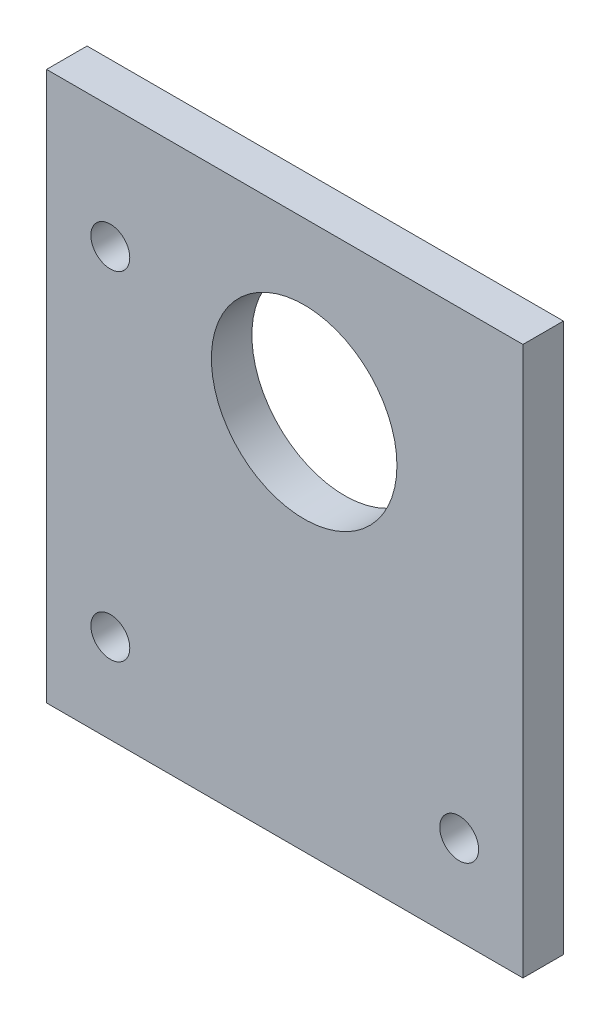
ISO-10303-21;
HEADER;
FILE_DESCRIPTION(('STEP AP214'),'2;1');
FILE_NAME('part.step','',(''),(''),'','','');
FILE_SCHEMA(('AUTOMOTIVE_DESIGN { 1 0 10303 214 1 1 1 1 }'));
ENDSEC;
DATA;
#1=APPLICATION_CONTEXT('core data for automotive mechanical design processes');
#2=APPLICATION_PROTOCOL_DEFINITION('international standard','automotive_design',2000,#1);
#3=PRODUCT_CONTEXT('',#1,'mechanical');
#4=PRODUCT('Part','Part','',(#3));
#5=PRODUCT_RELATED_PRODUCT_CATEGORY('part','',(#4));
#6=PRODUCT_DEFINITION_FORMATION('','',#4);
#7=PRODUCT_DEFINITION_CONTEXT('part definition',#1,'design');
#8=PRODUCT_DEFINITION('design','',#6,#7);
#9=PRODUCT_DEFINITION_SHAPE('','',#8);
#10=(LENGTH_UNIT() NAMED_UNIT(*) SI_UNIT(.MILLI.,.METRE.));
#11=(NAMED_UNIT(*) PLANE_ANGLE_UNIT() SI_UNIT($,.RADIAN.));
#12=(NAMED_UNIT(*) SI_UNIT($,.STERADIAN.) SOLID_ANGLE_UNIT());
#13=UNCERTAINTY_MEASURE_WITH_UNIT(LENGTH_MEASURE(1.E-05),#10,'distance_accuracy_value','');
#14=(GEOMETRIC_REPRESENTATION_CONTEXT(3) GLOBAL_UNCERTAINTY_ASSIGNED_CONTEXT((#13)) GLOBAL_UNIT_ASSIGNED_CONTEXT((#10,
#11,#12)) REPRESENTATION_CONTEXT('',''));
#15=CARTESIAN_POINT('',(0.,0.,0.));
#16=DIRECTION('',(0.,0.,1.));
#17=DIRECTION('',(1.,0.,0.));
#18=AXIS2_PLACEMENT_3D('',#15,#16,#17);
#19=CARTESIAN_POINT('',(0.,-59.69,6.35));
#20=DIRECTION('',(0.,1.,0.));
#21=DIRECTION('',(0.,0.,1.));
#22=AXIS2_PLACEMENT_3D('',#19,#20,#21);
#23=PLANE('',#22);
#24=DIRECTION('',(1.,0.,0.));
#25=VECTOR('',#24,1.);
#26=CARTESIAN_POINT('',(0.,-59.69,0.));
#27=LINE('',#26,#25);
#28=CARTESIAN_POINT('',(-40.3774369352808,-59.69,0.));
#29=VERTEX_POINT('',#28);
#30=CARTESIAN_POINT('',(34.29,-59.69,0.));
#31=VERTEX_POINT('',#30);
#32=EDGE_CURVE('E129',#29,#31,#27,.T.);
#33=ORIENTED_EDGE('',*,*,#32,.T.);
#34=DIRECTION('',(0.,0.,-1.));
#35=VECTOR('',#34,1.);
#36=CARTESIAN_POINT('',(34.29,-59.69,6.35));
#37=LINE('',#36,#35);
#38=CARTESIAN_POINT('',(34.29,-59.69,6.35));
#39=VERTEX_POINT('',#38);
#40=EDGE_CURVE('E11',#39,#31,#37,.T.);
#41=ORIENTED_EDGE('',*,*,#40,.F.);
#42=DIRECTION('',(1.,0.,0.));
#43=VECTOR('',#42,1.);
#44=CARTESIAN_POINT('',(0.,-59.69,6.35));
#45=LINE('',#44,#43);
#46=CARTESIAN_POINT('',(-40.3774369352808,-59.69,6.35));
#47=VERTEX_POINT('',#46);
#48=EDGE_CURVE('E95',#47,#39,#45,.T.);
#49=ORIENTED_EDGE('',*,*,#48,.F.);
#50=DIRECTION('',(0.,0.,-1.));
#51=VECTOR('',#50,1.);
#52=CARTESIAN_POINT('',(-40.3774369352808,-59.69,6.35));
#53=LINE('',#52,#51);
#54=EDGE_CURVE('E61',#47,#29,#53,.T.);
#55=ORIENTED_EDGE('',*,*,#54,.T.);
#56=EDGE_LOOP('',(#33,#41,#49,#55));
#57=FACE_BOUND('',#56,.T.);
#58=ADVANCED_FACE('F44',(#57),#23,.F.);
#59=CARTESIAN_POINT('',(34.29,0.,6.35));
#60=DIRECTION('',(-1.,0.,0.));
#61=DIRECTION('',(0.,0.,1.));
#62=AXIS2_PLACEMENT_3D('',#59,#60,#61);
#63=PLANE('',#62);
#64=DIRECTION('',(0.,1.,0.));
#65=VECTOR('',#64,1.);
#66=CARTESIAN_POINT('',(34.29,0.,0.));
#67=LINE('',#66,#65);
#68=CARTESIAN_POINT('',(34.29,26.3123969023602,0.));
#69=VERTEX_POINT('',#68);
#70=EDGE_CURVE('E101',#31,#69,#67,.T.);
#71=ORIENTED_EDGE('',*,*,#70,.T.);
#72=DIRECTION('',(0.,0.,-1.));
#73=VECTOR('',#72,1.);
#74=CARTESIAN_POINT('',(34.29,26.3123969023602,6.35));
#75=LINE('',#74,#73);
#76=CARTESIAN_POINT('',(34.29,26.3123969023602,6.35));
#77=VERTEX_POINT('',#76);
#78=EDGE_CURVE('E53',#77,#69,#75,.T.);
#79=ORIENTED_EDGE('',*,*,#78,.F.);
#80=DIRECTION('',(0.,1.,0.));
#81=VECTOR('',#80,1.);
#82=CARTESIAN_POINT('',(34.29,0.,6.35));
#83=LINE('',#82,#81);
#84=EDGE_CURVE('E86',#39,#77,#83,.T.);
#85=ORIENTED_EDGE('',*,*,#84,.F.);
#86=ORIENTED_EDGE('',*,*,#40,.T.);
#87=EDGE_LOOP('',(#71,#79,#85,#86));
#88=FACE_BOUND('',#87,.T.);
#89=ADVANCED_FACE('F100',(#88),#63,.F.);
#90=CARTESIAN_POINT('',(0.,26.3123969023602,6.35));
#91=DIRECTION('',(0.,1.,0.));
#92=DIRECTION('',(0.,0.,1.));
#93=AXIS2_PLACEMENT_3D('',#90,#91,#92);
#94=PLANE('',#93);
#95=DIRECTION('',(1.,0.,0.));
#96=VECTOR('',#95,1.);
#97=CARTESIAN_POINT('',(0.,26.3123969023602,0.));
#98=LINE('',#97,#96);
#99=CARTESIAN_POINT('',(-40.3774369352808,26.3123969023602,0.));
#100=VERTEX_POINT('',#99);
#101=EDGE_CURVE('E134',#100,#69,#98,.T.);
#102=ORIENTED_EDGE('',*,*,#101,.F.);
#103=DIRECTION('',(0.,0.,-1.));
#104=VECTOR('',#103,1.);
#105=CARTESIAN_POINT('',(-40.3774369352808,26.3123969023602,6.35));
#106=LINE('',#105,#104);
#107=CARTESIAN_POINT('',(-40.3774369352808,26.3123969023602,6.35));
#108=VERTEX_POINT('',#107);
#109=EDGE_CURVE('E75',#108,#100,#106,.T.);
#110=ORIENTED_EDGE('',*,*,#109,.F.);
#111=DIRECTION('',(1.,0.,0.));
#112=VECTOR('',#111,1.);
#113=CARTESIAN_POINT('',(0.,26.3123969023602,6.35));
#114=LINE('',#113,#112);
#115=EDGE_CURVE('E94',#108,#77,#114,.T.);
#116=ORIENTED_EDGE('',*,*,#115,.T.);
#117=ORIENTED_EDGE('',*,*,#78,.T.);
#118=EDGE_LOOP('',(#102,#110,#116,#117));
#119=FACE_BOUND('',#118,.T.);
#120=ADVANCED_FACE('F105',(#119),#94,.T.);
#121=CARTESIAN_POINT('',(24.2951,-45.72,6.35));
#122=DIRECTION('',(0.,0.,-1.));
#123=DIRECTION('',(-1.,0.,0.));
#124=AXIS2_PLACEMENT_3D('',#121,#122,#123);
#125=CYLINDRICAL_SURFACE('',#124,3.048);
#126=CARTESIAN_POINT('',(24.2951,-45.72,6.35));
#127=DIRECTION('',(0.,0.,1.));
#128=DIRECTION('',(1.,0.,0.));
#129=AXIS2_PLACEMENT_3D('',#126,#127,#128);
#130=CIRCLE('',#129,3.048);
#131=CARTESIAN_POINT('',(27.3431,-45.72,6.35));
#132=VERTEX_POINT('',#131);
#133=EDGE_CURVE('E121',#132,#132,#130,.T.);
#134=ORIENTED_EDGE('',*,*,#133,.T.);
#135=EDGE_LOOP('',(#134));
#136=FACE_BOUND('',#135,.T.);
#137=CARTESIAN_POINT('',(24.2951,-45.72,0.));
#138=DIRECTION('',(0.,0.,1.));
#139=DIRECTION('',(1.,0.,0.));
#140=AXIS2_PLACEMENT_3D('',#137,#138,#139);
#141=CIRCLE('',#140,3.048);
#142=CARTESIAN_POINT('',(27.3431,-45.72,0.));
#143=VERTEX_POINT('',#142);
#144=EDGE_CURVE('E149',#143,#143,#141,.T.);
#145=ORIENTED_EDGE('',*,*,#144,.F.);
#146=EDGE_LOOP('',(#145));
#147=FACE_BOUND('',#146,.T.);
#148=ADVANCED_FACE('F192',(#136,#147),#125,.F.);
#149=CARTESIAN_POINT('',(0.,0.,6.35));
#150=DIRECTION('',(0.,0.,-1.));
#151=DIRECTION('',(-1.,0.,0.));
#152=AXIS2_PLACEMENT_3D('',#149,#150,#151);
#153=CYLINDRICAL_SURFACE('',#152,14.5415);
#154=CARTESIAN_POINT('',(0.,0.,6.35));
#155=DIRECTION('',(0.,0.,1.));
#156=DIRECTION('',(1.,0.,0.));
#157=AXIS2_PLACEMENT_3D('',#154,#155,#156);
#158=CIRCLE('',#157,14.5415);
#159=CARTESIAN_POINT('',(14.5415,0.,6.35));
#160=VERTEX_POINT('',#159);
#161=EDGE_CURVE('E117',#160,#160,#158,.T.);
#162=ORIENTED_EDGE('',*,*,#161,.T.);
#163=EDGE_LOOP('',(#162));
#164=FACE_BOUND('',#163,.T.);
#165=CARTESIAN_POINT('',(0.,0.,0.));
#166=DIRECTION('',(0.,0.,1.));
#167=DIRECTION('',(1.,0.,0.));
#168=AXIS2_PLACEMENT_3D('',#165,#166,#167);
#169=CIRCLE('',#168,14.5415);
#170=CARTESIAN_POINT('',(14.5415,0.,0.));
#171=VERTEX_POINT('',#170);
#172=EDGE_CURVE('E145',#171,#171,#169,.T.);
#173=ORIENTED_EDGE('',*,*,#172,.F.);
#174=EDGE_LOOP('',(#173));
#175=FACE_BOUND('',#174,.T.);
#176=ADVANCED_FACE('F194',(#164,#175),#153,.F.);
#177=CARTESIAN_POINT('',(-30.3825369352808,7.26239690236022,6.35));
#178=DIRECTION('',(0.,0.,-1.));
#179=DIRECTION('',(-1.,0.,0.));
#180=AXIS2_PLACEMENT_3D('',#177,#178,#179);
#181=CYLINDRICAL_SURFACE('',#180,3.048);
#182=CARTESIAN_POINT('',(-30.3825369352808,7.26239690236022,6.35));
#183=DIRECTION('',(0.,0.,1.));
#184=DIRECTION('',(1.,0.,0.));
#185=AXIS2_PLACEMENT_3D('',#182,#183,#184);
#186=CIRCLE('',#185,3.048);
#187=CARTESIAN_POINT('',(-27.3345369352808,7.26239690236022,6.35));
#188=VERTEX_POINT('',#187);
#189=EDGE_CURVE('E110',#188,#188,#186,.T.);
#190=ORIENTED_EDGE('',*,*,#189,.T.);
#191=EDGE_LOOP('',(#190));
#192=FACE_BOUND('',#191,.T.);
#193=CARTESIAN_POINT('',(-30.3825369352808,7.26239690236022,0.));
#194=DIRECTION('',(0.,0.,1.));
#195=DIRECTION('',(1.,0.,0.));
#196=AXIS2_PLACEMENT_3D('',#193,#194,#195);
#197=CIRCLE('',#196,3.048);
#198=CARTESIAN_POINT('',(-27.3345369352808,7.26239690236022,0.));
#199=VERTEX_POINT('',#198);
#200=EDGE_CURVE('E141',#199,#199,#197,.T.);
#201=ORIENTED_EDGE('',*,*,#200,.F.);
#202=EDGE_LOOP('',(#201));
#203=FACE_BOUND('',#202,.T.);
#204=ADVANCED_FACE('F175',(#192,#203),#181,.F.);
#205=CARTESIAN_POINT('',(-40.3774369352808,0.,6.35));
#206=DIRECTION('',(-1.,0.,0.));
#207=DIRECTION('',(0.,0.,1.));
#208=AXIS2_PLACEMENT_3D('',#205,#206,#207);
#209=PLANE('',#208);
#210=DIRECTION('',(0.,1.,0.));
#211=VECTOR('',#210,1.);
#212=CARTESIAN_POINT('',(-40.3774369352808,0.,0.));
#213=LINE('',#212,#211);
#214=EDGE_CURVE('E137',#29,#100,#213,.T.);
#215=ORIENTED_EDGE('',*,*,#214,.F.);
#216=ORIENTED_EDGE('',*,*,#54,.F.);
#217=DIRECTION('',(0.,1.,0.));
#218=VECTOR('',#217,1.);
#219=CARTESIAN_POINT('',(-40.3774369352808,0.,6.35));
#220=LINE('',#219,#218);
#221=EDGE_CURVE('E107',#47,#108,#220,.T.);
#222=ORIENTED_EDGE('',*,*,#221,.T.);
#223=ORIENTED_EDGE('',*,*,#109,.T.);
#224=EDGE_LOOP('',(#215,#216,#222,#223));
#225=FACE_BOUND('',#224,.T.);
#226=ADVANCED_FACE('F167',(#225),#209,.T.);
#227=CARTESIAN_POINT('',(-30.3825369352808,-45.72,6.35));
#228=DIRECTION('',(0.,0.,-1.));
#229=DIRECTION('',(-1.,0.,0.));
#230=AXIS2_PLACEMENT_3D('',#227,#228,#229);
#231=CYLINDRICAL_SURFACE('',#230,3.048);
#232=CARTESIAN_POINT('',(-30.3825369352808,-45.72,6.35));
#233=DIRECTION('',(0.,0.,1.));
#234=DIRECTION('',(1.,0.,0.));
#235=AXIS2_PLACEMENT_3D('',#232,#233,#234);
#236=CIRCLE('',#235,3.048);
#237=CARTESIAN_POINT('',(-27.3345369352808,-45.72,6.35));
#238=VERTEX_POINT('',#237);
#239=EDGE_CURVE('E125',#238,#238,#236,.T.);
#240=ORIENTED_EDGE('',*,*,#239,.T.);
#241=EDGE_LOOP('',(#240));
#242=FACE_BOUND('',#241,.T.);
#243=CARTESIAN_POINT('',(-30.3825369352808,-45.72,0.));
#244=DIRECTION('',(0.,0.,1.));
#245=DIRECTION('',(1.,0.,0.));
#246=AXIS2_PLACEMENT_3D('',#243,#244,#245);
#247=CIRCLE('',#246,3.048);
#248=CARTESIAN_POINT('',(-27.3345369352808,-45.72,0.));
#249=VERTEX_POINT('',#248);
#250=EDGE_CURVE('E153',#249,#249,#247,.T.);
#251=ORIENTED_EDGE('',*,*,#250,.F.);
#252=EDGE_LOOP('',(#251));
#253=FACE_BOUND('',#252,.T.);
#254=ADVANCED_FACE('F165',(#242,#253),#231,.F.);
#255=CARTESIAN_POINT('',(0.,0.,6.35));
#256=DIRECTION('',(0.,0.,1.));
#257=DIRECTION('',(1.,0.,0.));
#258=AXIS2_PLACEMENT_3D('',#255,#256,#257);
#259=PLANE('',#258);
#260=ORIENTED_EDGE('',*,*,#48,.T.);
#261=ORIENTED_EDGE('',*,*,#84,.T.);
#262=ORIENTED_EDGE('',*,*,#115,.F.);
#263=ORIENTED_EDGE('',*,*,#221,.F.);
#264=EDGE_LOOP('',(#260,#261,#262,#263));
#265=FACE_BOUND('',#264,.T.);
#266=ORIENTED_EDGE('',*,*,#189,.F.);
#267=EDGE_LOOP('',(#266));
#268=FACE_BOUND('',#267,.T.);
#269=ORIENTED_EDGE('',*,*,#161,.F.);
#270=EDGE_LOOP('',(#269));
#271=FACE_BOUND('',#270,.T.);
#272=ORIENTED_EDGE('',*,*,#133,.F.);
#273=EDGE_LOOP('',(#272));
#274=FACE_BOUND('',#273,.T.);
#275=ORIENTED_EDGE('',*,*,#239,.F.);
#276=EDGE_LOOP('',(#275));
#277=FACE_BOUND('',#276,.T.);
#278=ADVANCED_FACE('F90',(#265,#268,#271,#274,#277),#259,.T.);
#279=CARTESIAN_POINT('',(0.,0.,0.));
#280=DIRECTION('',(0.,0.,1.));
#281=DIRECTION('',(1.,0.,0.));
#282=AXIS2_PLACEMENT_3D('',#279,#280,#281);
#283=PLANE('',#282);
#284=ORIENTED_EDGE('',*,*,#32,.F.);
#285=ORIENTED_EDGE('',*,*,#214,.T.);
#286=ORIENTED_EDGE('',*,*,#101,.T.);
#287=ORIENTED_EDGE('',*,*,#70,.F.);
#288=EDGE_LOOP('',(#284,#285,#286,#287));
#289=FACE_BOUND('',#288,.T.);
#290=ORIENTED_EDGE('',*,*,#200,.T.);
#291=EDGE_LOOP('',(#290));
#292=FACE_BOUND('',#291,.T.);
#293=ORIENTED_EDGE('',*,*,#172,.T.);
#294=EDGE_LOOP('',(#293));
#295=FACE_BOUND('',#294,.T.);
#296=ORIENTED_EDGE('',*,*,#144,.T.);
#297=EDGE_LOOP('',(#296));
#298=FACE_BOUND('',#297,.T.);
#299=ORIENTED_EDGE('',*,*,#250,.T.);
#300=EDGE_LOOP('',(#299));
#301=FACE_BOUND('',#300,.T.);
#302=ADVANCED_FACE('F163',(#289,#292,#295,#298,#301),#283,.F.);
#303=CLOSED_SHELL('',(#58,#89,#120,#148,#176,#204,#226,#254,#278,#302));
#304=MANIFOLD_SOLID_BREP('B2',#303);
#305=ADVANCED_BREP_SHAPE_REPRESENTATION('',(#18,#304),#14);
#306=SHAPE_DEFINITION_REPRESENTATION(#9,#305);
ENDSEC;
END-ISO-10303-21;
